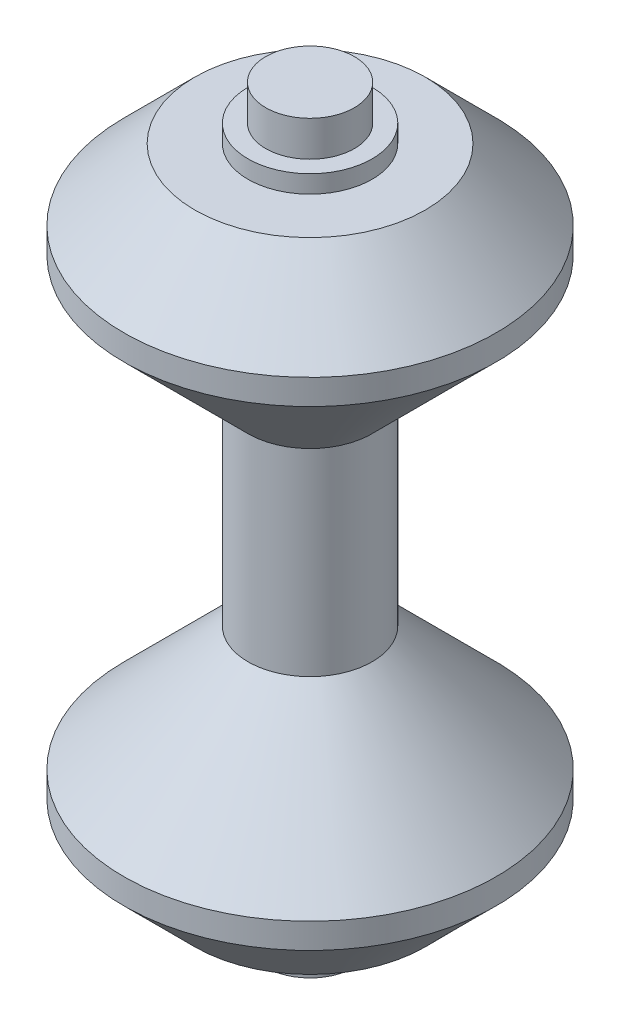
ISO-10303-21;
HEADER;
FILE_DESCRIPTION(('STEP AP214'),'2;1');
FILE_NAME('part.step','',(''),(''),'','','');
FILE_SCHEMA(('AUTOMOTIVE_DESIGN { 1 0 10303 214 1 1 1 1 }'));
ENDSEC;
DATA;
#1=APPLICATION_CONTEXT('core data for automotive mechanical design processes');
#2=APPLICATION_PROTOCOL_DEFINITION('international standard','automotive_design',2000,#1);
#3=PRODUCT_CONTEXT('',#1,'mechanical');
#4=PRODUCT('Part','Part','',(#3));
#5=PRODUCT_RELATED_PRODUCT_CATEGORY('part','',(#4));
#6=PRODUCT_DEFINITION_FORMATION('','',#4);
#7=PRODUCT_DEFINITION_CONTEXT('part definition',#1,'design');
#8=PRODUCT_DEFINITION('design','',#6,#7);
#9=PRODUCT_DEFINITION_SHAPE('','',#8);
#10=(LENGTH_UNIT() NAMED_UNIT(*) SI_UNIT(.MILLI.,.METRE.));
#11=(NAMED_UNIT(*) PLANE_ANGLE_UNIT() SI_UNIT($,.RADIAN.));
#12=(NAMED_UNIT(*) SI_UNIT($,.STERADIAN.) SOLID_ANGLE_UNIT());
#13=UNCERTAINTY_MEASURE_WITH_UNIT(LENGTH_MEASURE(1.E-05),#10,'distance_accuracy_value','');
#14=(GEOMETRIC_REPRESENTATION_CONTEXT(3) GLOBAL_UNCERTAINTY_ASSIGNED_CONTEXT((#13)) GLOBAL_UNIT_ASSIGNED_CONTEXT((#10,
#11,#12)) REPRESENTATION_CONTEXT('',''));
#15=CARTESIAN_POINT('',(0.,0.,0.));
#16=DIRECTION('',(0.,0.,1.));
#17=DIRECTION('',(1.,0.,0.));
#18=AXIS2_PLACEMENT_3D('',#15,#16,#17);
#19=CARTESIAN_POINT('',(0.,21.,0.));
#20=DIRECTION('',(0.,-1.,0.));
#21=DIRECTION('',(1.,0.,0.));
#22=AXIS2_PLACEMENT_3D('',#19,#20,#21);
#23=PLANE('',#22);
#24=CARTESIAN_POINT('',(0.,21.,0.));
#25=DIRECTION('',(0.,1.,0.));
#26=DIRECTION('',(-1.,0.,0.));
#27=AXIS2_PLACEMENT_3D('',#24,#25,#26);
#28=CIRCLE('',#27,2.5);
#29=CARTESIAN_POINT('',(-2.5,21.,0.));
#30=VERTEX_POINT('',#29);
#31=EDGE_CURVE('E10',#30,#30,#28,.T.);
#32=ORIENTED_EDGE('',*,*,#31,.T.);
#33=EDGE_LOOP('',(#32));
#34=FACE_BOUND('',#33,.T.);
#35=ADVANCED_FACE('F30',(#34),#23,.F.);
#36=CARTESIAN_POINT('',(0.,21.,0.));
#37=DIRECTION('',(0.,1.,0.));
#38=DIRECTION('',(-1.,0.,0.));
#39=AXIS2_PLACEMENT_3D('',#36,#37,#38);
#40=CYLINDRICAL_SURFACE('',#39,2.5);
#41=ORIENTED_EDGE('',*,*,#31,.F.);
#42=EDGE_LOOP('',(#41));
#43=FACE_BOUND('',#42,.T.);
#44=CARTESIAN_POINT('',(0.,19.,0.));
#45=DIRECTION('',(0.,1.,0.));
#46=DIRECTION('',(-1.,0.,0.));
#47=AXIS2_PLACEMENT_3D('',#44,#45,#46);
#48=CIRCLE('',#47,2.5);
#49=CARTESIAN_POINT('',(-2.5,19.,0.));
#50=VERTEX_POINT('',#49);
#51=EDGE_CURVE('E36',#50,#50,#48,.T.);
#52=ORIENTED_EDGE('',*,*,#51,.T.);
#53=EDGE_LOOP('',(#52));
#54=FACE_BOUND('',#53,.T.);
#55=ADVANCED_FACE('F100',(#43,#54),#40,.T.);
#56=CARTESIAN_POINT('',(2.5,19.,0.));
#57=DIRECTION('',(0.,-1.,0.));
#58=DIRECTION('',(1.,0.,0.));
#59=AXIS2_PLACEMENT_3D('',#56,#57,#58);
#60=PLANE('',#59);
#61=ORIENTED_EDGE('',*,*,#51,.F.);
#62=EDGE_LOOP('',(#61));
#63=FACE_BOUND('',#62,.T.);
#64=CARTESIAN_POINT('',(0.,19.,0.));
#65=DIRECTION('',(0.,1.,0.));
#66=DIRECTION('',(-1.,0.,0.));
#67=AXIS2_PLACEMENT_3D('',#64,#65,#66);
#68=CIRCLE('',#67,3.5);
#69=CARTESIAN_POINT('',(-3.5,19.,0.));
#70=VERTEX_POINT('',#69);
#71=EDGE_CURVE('E40',#70,#70,#68,.T.);
#72=ORIENTED_EDGE('',*,*,#71,.T.);
#73=EDGE_LOOP('',(#72));
#74=FACE_BOUND('',#73,.T.);
#75=ADVANCED_FACE('F104',(#63,#74),#60,.F.);
#76=CARTESIAN_POINT('',(0.,21.,0.));
#77=DIRECTION('',(0.,1.,0.));
#78=DIRECTION('',(-1.,0.,0.));
#79=AXIS2_PLACEMENT_3D('',#76,#77,#78);
#80=CYLINDRICAL_SURFACE('',#79,3.5);
#81=ORIENTED_EDGE('',*,*,#71,.F.);
#82=EDGE_LOOP('',(#81));
#83=FACE_BOUND('',#82,.T.);
#84=CARTESIAN_POINT('',(0.,18.,0.));
#85=DIRECTION('',(0.,1.,0.));
#86=DIRECTION('',(-1.,0.,0.));
#87=AXIS2_PLACEMENT_3D('',#84,#85,#86);
#88=CIRCLE('',#87,3.5);
#89=CARTESIAN_POINT('',(-3.5,18.,0.));
#90=VERTEX_POINT('',#89);
#91=EDGE_CURVE('E44',#90,#90,#88,.T.);
#92=ORIENTED_EDGE('',*,*,#91,.T.);
#93=EDGE_LOOP('',(#92));
#94=FACE_BOUND('',#93,.T.);
#95=ADVANCED_FACE('F109',(#83,#94),#80,.T.);
#96=CARTESIAN_POINT('',(3.5,18.,0.));
#97=DIRECTION('',(0.,-1.,0.));
#98=DIRECTION('',(1.,0.,0.));
#99=AXIS2_PLACEMENT_3D('',#96,#97,#98);
#100=PLANE('',#99);
#101=ORIENTED_EDGE('',*,*,#91,.F.);
#102=EDGE_LOOP('',(#101));
#103=FACE_BOUND('',#102,.T.);
#104=CARTESIAN_POINT('',(0.,18.,0.));
#105=DIRECTION('',(0.,1.,0.));
#106=DIRECTION('',(-1.,0.,0.));
#107=AXIS2_PLACEMENT_3D('',#104,#105,#106);
#108=CIRCLE('',#107,6.50000000000006);
#109=CARTESIAN_POINT('',(-6.50000000000006,18.,0.));
#110=VERTEX_POINT('',#109);
#111=EDGE_CURVE('E49',#110,#110,#108,.T.);
#112=ORIENTED_EDGE('',*,*,#111,.T.);
#113=EDGE_LOOP('',(#112));
#114=FACE_BOUND('',#113,.T.);
#115=ADVANCED_FACE('F115',(#103,#114),#100,.F.);
#116=CARTESIAN_POINT('',(0.,14.,0.));
#117=DIRECTION('',(0.,-1.,0.));
#118=DIRECTION('',(1.,0.,0.));
#119=AXIS2_PLACEMENT_3D('',#116,#117,#118);
#120=CONICAL_SURFACE('',#119,10.5000000000001,0.78539816339745);
#121=ORIENTED_EDGE('',*,*,#111,.F.);
#122=EDGE_LOOP('',(#121));
#123=FACE_BOUND('',#122,.T.);
#124=CARTESIAN_POINT('',(0.,14.,0.));
#125=DIRECTION('',(0.,1.,0.));
#126=DIRECTION('',(-1.,0.,0.));
#127=AXIS2_PLACEMENT_3D('',#124,#125,#126);
#128=CIRCLE('',#127,10.5000000000001);
#129=CARTESIAN_POINT('',(-10.5000000000001,14.,0.));
#130=VERTEX_POINT('',#129);
#131=EDGE_CURVE('E52',#130,#130,#128,.T.);
#132=ORIENTED_EDGE('',*,*,#131,.T.);
#133=EDGE_LOOP('',(#132));
#134=FACE_BOUND('',#133,.T.);
#135=ADVANCED_FACE('F119',(#123,#134),#120,.T.);
#136=CARTESIAN_POINT('',(0.,21.,0.));
#137=DIRECTION('',(0.,1.,0.));
#138=DIRECTION('',(-1.,0.,0.));
#139=AXIS2_PLACEMENT_3D('',#136,#137,#138);
#140=CYLINDRICAL_SURFACE('',#139,10.5000000000001);
#141=ORIENTED_EDGE('',*,*,#131,.F.);
#142=EDGE_LOOP('',(#141));
#143=FACE_BOUND('',#142,.T.);
#144=CARTESIAN_POINT('',(0.,12.5717820793592,0.));
#145=DIRECTION('',(0.,1.,0.));
#146=DIRECTION('',(-1.,0.,0.));
#147=AXIS2_PLACEMENT_3D('',#144,#145,#146);
#148=CIRCLE('',#147,10.5000000000001);
#149=CARTESIAN_POINT('',(-10.5000000000001,12.5717820793592,0.));
#150=VERTEX_POINT('',#149);
#151=EDGE_CURVE('E55',#150,#150,#148,.T.);
#152=ORIENTED_EDGE('',*,*,#151,.T.);
#153=EDGE_LOOP('',(#152));
#154=FACE_BOUND('',#153,.T.);
#155=ADVANCED_FACE('F123',(#143,#154),#140,.T.);
#156=CARTESIAN_POINT('',(0.,5.57178207935917,0.));
#157=DIRECTION('',(0.,1.,0.));
#158=DIRECTION('',(-1.,0.,0.));
#159=AXIS2_PLACEMENT_3D('',#156,#157,#158);
#160=CONICAL_SURFACE('',#159,3.5,0.785398163397453);
#161=ORIENTED_EDGE('',*,*,#151,.F.);
#162=EDGE_LOOP('',(#161));
#163=FACE_BOUND('',#162,.T.);
#164=CARTESIAN_POINT('',(0.,5.57178207935917,0.));
#165=DIRECTION('',(0.,1.,0.));
#166=DIRECTION('',(-1.,0.,0.));
#167=AXIS2_PLACEMENT_3D('',#164,#165,#166);
#168=CIRCLE('',#167,3.5);
#169=CARTESIAN_POINT('',(-3.5,5.57178207935917,0.));
#170=VERTEX_POINT('',#169);
#171=EDGE_CURVE('E58',#170,#170,#168,.T.);
#172=ORIENTED_EDGE('',*,*,#171,.T.);
#173=EDGE_LOOP('',(#172));
#174=FACE_BOUND('',#173,.T.);
#175=ADVANCED_FACE('F127',(#163,#174),#160,.T.);
#176=CARTESIAN_POINT('',(0.,21.,0.));
#177=DIRECTION('',(0.,1.,0.));
#178=DIRECTION('',(-1.,0.,0.));
#179=AXIS2_PLACEMENT_3D('',#176,#177,#178);
#180=CYLINDRICAL_SURFACE('',#179,3.5);
#181=ORIENTED_EDGE('',*,*,#171,.F.);
#182=EDGE_LOOP('',(#181));
#183=FACE_BOUND('',#182,.T.);
#184=CARTESIAN_POINT('',(0.,-5.57178207935917,0.));
#185=DIRECTION('',(0.,1.,0.));
#186=DIRECTION('',(-1.,0.,0.));
#187=AXIS2_PLACEMENT_3D('',#184,#185,#186);
#188=CIRCLE('',#187,3.5);
#189=CARTESIAN_POINT('',(-3.5,-5.57178207935917,0.));
#190=VERTEX_POINT('',#189);
#191=EDGE_CURVE('E82',#190,#190,#188,.T.);
#192=ORIENTED_EDGE('',*,*,#191,.T.);
#193=EDGE_LOOP('',(#192));
#194=FACE_BOUND('',#193,.T.);
#195=ADVANCED_FACE('F86',(#183,#194),#180,.T.);
#196=CARTESIAN_POINT('',(0.,-21.,0.));
#197=DIRECTION('',(0.,1.,0.));
#198=DIRECTION('',(1.,0.,0.));
#199=AXIS2_PLACEMENT_3D('',#196,#197,#198);
#200=PLANE('',#199);
#201=CARTESIAN_POINT('',(0.,-21.,0.));
#202=DIRECTION('',(0.,1.,0.));
#203=DIRECTION('',(-1.,0.,0.));
#204=AXIS2_PLACEMENT_3D('',#201,#202,#203);
#205=CIRCLE('',#204,2.5);
#206=CARTESIAN_POINT('',(-2.5,-21.,0.));
#207=VERTEX_POINT('',#206);
#208=EDGE_CURVE('E61',#207,#207,#205,.T.);
#209=ORIENTED_EDGE('',*,*,#208,.F.);
#210=EDGE_LOOP('',(#209));
#211=FACE_BOUND('',#210,.T.);
#212=ADVANCED_FACE('F134',(#211),#200,.F.);
#213=CARTESIAN_POINT('',(0.,-21.,0.));
#214=DIRECTION('',(0.,-1.,0.));
#215=DIRECTION('',(-1.,0.,0.));
#216=AXIS2_PLACEMENT_3D('',#213,#214,#215);
#217=CYLINDRICAL_SURFACE('',#216,2.5);
#218=ORIENTED_EDGE('',*,*,#208,.T.);
#219=EDGE_LOOP('',(#218));
#220=FACE_BOUND('',#219,.T.);
#221=CARTESIAN_POINT('',(0.,-19.,0.));
#222=DIRECTION('',(0.,1.,0.));
#223=DIRECTION('',(-1.,0.,0.));
#224=AXIS2_PLACEMENT_3D('',#221,#222,#223);
#225=CIRCLE('',#224,2.5);
#226=CARTESIAN_POINT('',(-2.5,-19.,0.));
#227=VERTEX_POINT('',#226);
#228=EDGE_CURVE('E64',#227,#227,#225,.T.);
#229=ORIENTED_EDGE('',*,*,#228,.F.);
#230=EDGE_LOOP('',(#229));
#231=FACE_BOUND('',#230,.T.);
#232=ADVANCED_FACE('F138',(#220,#231),#217,.T.);
#233=CARTESIAN_POINT('',(2.5,-19.,0.));
#234=DIRECTION('',(0.,1.,0.));
#235=DIRECTION('',(1.,0.,0.));
#236=AXIS2_PLACEMENT_3D('',#233,#234,#235);
#237=PLANE('',#236);
#238=ORIENTED_EDGE('',*,*,#228,.T.);
#239=EDGE_LOOP('',(#238));
#240=FACE_BOUND('',#239,.T.);
#241=CARTESIAN_POINT('',(0.,-19.,0.));
#242=DIRECTION('',(0.,1.,0.));
#243=DIRECTION('',(-1.,0.,0.));
#244=AXIS2_PLACEMENT_3D('',#241,#242,#243);
#245=CIRCLE('',#244,3.5);
#246=CARTESIAN_POINT('',(-3.5,-19.,0.));
#247=VERTEX_POINT('',#246);
#248=EDGE_CURVE('E67',#247,#247,#245,.T.);
#249=ORIENTED_EDGE('',*,*,#248,.F.);
#250=EDGE_LOOP('',(#249));
#251=FACE_BOUND('',#250,.T.);
#252=ADVANCED_FACE('F142',(#240,#251),#237,.F.);
#253=CARTESIAN_POINT('',(0.,-21.,0.));
#254=DIRECTION('',(0.,-1.,0.));
#255=DIRECTION('',(-1.,0.,0.));
#256=AXIS2_PLACEMENT_3D('',#253,#254,#255);
#257=CYLINDRICAL_SURFACE('',#256,3.5);
#258=ORIENTED_EDGE('',*,*,#248,.T.);
#259=EDGE_LOOP('',(#258));
#260=FACE_BOUND('',#259,.T.);
#261=CARTESIAN_POINT('',(0.,-18.,0.));
#262=DIRECTION('',(0.,1.,0.));
#263=DIRECTION('',(-1.,0.,0.));
#264=AXIS2_PLACEMENT_3D('',#261,#262,#263);
#265=CIRCLE('',#264,3.5);
#266=CARTESIAN_POINT('',(-3.5,-18.,0.));
#267=VERTEX_POINT('',#266);
#268=EDGE_CURVE('E70',#267,#267,#265,.T.);
#269=ORIENTED_EDGE('',*,*,#268,.F.);
#270=EDGE_LOOP('',(#269));
#271=FACE_BOUND('',#270,.T.);
#272=ADVANCED_FACE('F146',(#260,#271),#257,.T.);
#273=CARTESIAN_POINT('',(3.5,-18.,0.));
#274=DIRECTION('',(0.,1.,0.));
#275=DIRECTION('',(1.,0.,0.));
#276=AXIS2_PLACEMENT_3D('',#273,#274,#275);
#277=PLANE('',#276);
#278=ORIENTED_EDGE('',*,*,#268,.T.);
#279=EDGE_LOOP('',(#278));
#280=FACE_BOUND('',#279,.T.);
#281=CARTESIAN_POINT('',(0.,-18.,0.));
#282=DIRECTION('',(0.,1.,0.));
#283=DIRECTION('',(-1.,0.,0.));
#284=AXIS2_PLACEMENT_3D('',#281,#282,#283);
#285=CIRCLE('',#284,6.50000000000006);
#286=CARTESIAN_POINT('',(-6.50000000000006,-18.,0.));
#287=VERTEX_POINT('',#286);
#288=EDGE_CURVE('E73',#287,#287,#285,.T.);
#289=ORIENTED_EDGE('',*,*,#288,.F.);
#290=EDGE_LOOP('',(#289));
#291=FACE_BOUND('',#290,.T.);
#292=ADVANCED_FACE('F150',(#280,#291),#277,.F.);
#293=CARTESIAN_POINT('',(0.,-14.,0.));
#294=DIRECTION('',(0.,1.,0.));
#295=DIRECTION('',(1.,0.,0.));
#296=AXIS2_PLACEMENT_3D('',#293,#294,#295);
#297=CONICAL_SURFACE('',#296,10.5000000000001,0.78539816339745);
#298=ORIENTED_EDGE('',*,*,#288,.T.);
#299=EDGE_LOOP('',(#298));
#300=FACE_BOUND('',#299,.T.);
#301=CARTESIAN_POINT('',(0.,-14.,0.));
#302=DIRECTION('',(0.,1.,0.));
#303=DIRECTION('',(-1.,0.,0.));
#304=AXIS2_PLACEMENT_3D('',#301,#302,#303);
#305=CIRCLE('',#304,10.5000000000001);
#306=CARTESIAN_POINT('',(-10.5000000000001,-14.,0.));
#307=VERTEX_POINT('',#306);
#308=EDGE_CURVE('E76',#307,#307,#305,.T.);
#309=ORIENTED_EDGE('',*,*,#308,.F.);
#310=EDGE_LOOP('',(#309));
#311=FACE_BOUND('',#310,.T.);
#312=ADVANCED_FACE('F96',(#300,#311),#297,.T.);
#313=CARTESIAN_POINT('',(0.,-21.,0.));
#314=DIRECTION('',(0.,-1.,0.));
#315=DIRECTION('',(-1.,0.,0.));
#316=AXIS2_PLACEMENT_3D('',#313,#314,#315);
#317=CYLINDRICAL_SURFACE('',#316,10.5000000000001);
#318=ORIENTED_EDGE('',*,*,#308,.T.);
#319=EDGE_LOOP('',(#318));
#320=FACE_BOUND('',#319,.T.);
#321=CARTESIAN_POINT('',(0.,-12.5717820793592,0.));
#322=DIRECTION('',(0.,1.,0.));
#323=DIRECTION('',(-1.,0.,0.));
#324=AXIS2_PLACEMENT_3D('',#321,#322,#323);
#325=CIRCLE('',#324,10.5000000000001);
#326=CARTESIAN_POINT('',(-10.5000000000001,-12.5717820793592,0.));
#327=VERTEX_POINT('',#326);
#328=EDGE_CURVE('E79',#327,#327,#325,.T.);
#329=ORIENTED_EDGE('',*,*,#328,.F.);
#330=EDGE_LOOP('',(#329));
#331=FACE_BOUND('',#330,.T.);
#332=ADVANCED_FACE('F90',(#320,#331),#317,.T.);
#333=CARTESIAN_POINT('',(0.,-5.57178207935917,0.));
#334=DIRECTION('',(0.,-1.,0.));
#335=DIRECTION('',(-1.,0.,0.));
#336=AXIS2_PLACEMENT_3D('',#333,#334,#335);
#337=CONICAL_SURFACE('',#336,3.5,0.785398163397453);
#338=ORIENTED_EDGE('',*,*,#328,.T.);
#339=EDGE_LOOP('',(#338));
#340=FACE_BOUND('',#339,.T.);
#341=ORIENTED_EDGE('',*,*,#191,.F.);
#342=EDGE_LOOP('',(#341));
#343=FACE_BOUND('',#342,.T.);
#344=ADVANCED_FACE('F88',(#340,#343),#337,.T.);
#345=CLOSED_SHELL('',(#35,#55,#75,#95,#115,#135,#155,#175,#195,#212,#232,#252,#272,#292,#312,
#332,#344));
#346=MANIFOLD_SOLID_BREP('B2',#345);
#347=ADVANCED_BREP_SHAPE_REPRESENTATION('',(#18,#346),#14);
#348=SHAPE_DEFINITION_REPRESENTATION(#9,#347);
ENDSEC;
END-ISO-10303-21;
